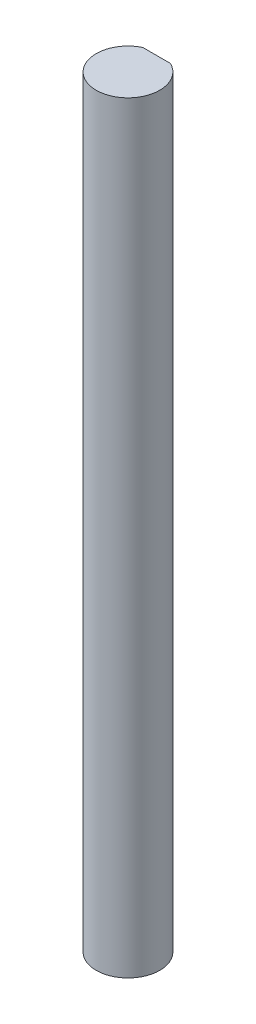
ISO-10303-21;
HEADER;
FILE_DESCRIPTION(('STEP AP214'),'2;1');
FILE_NAME('part.step','',(''),(''),'','','');
FILE_SCHEMA(('AUTOMOTIVE_DESIGN { 1 0 10303 214 1 1 1 1 }'));
ENDSEC;
DATA;
#1=APPLICATION_CONTEXT('core data for automotive mechanical design processes');
#2=APPLICATION_PROTOCOL_DEFINITION('international standard','automotive_design',2000,#1);
#3=PRODUCT_CONTEXT('',#1,'mechanical');
#4=PRODUCT('Part','Part','',(#3));
#5=PRODUCT_RELATED_PRODUCT_CATEGORY('part','',(#4));
#6=PRODUCT_DEFINITION_FORMATION('','',#4);
#7=PRODUCT_DEFINITION_CONTEXT('part definition',#1,'design');
#8=PRODUCT_DEFINITION('design','',#6,#7);
#9=PRODUCT_DEFINITION_SHAPE('','',#8);
#10=(LENGTH_UNIT() NAMED_UNIT(*) SI_UNIT(.MILLI.,.METRE.));
#11=(NAMED_UNIT(*) PLANE_ANGLE_UNIT() SI_UNIT($,.RADIAN.));
#12=(NAMED_UNIT(*) SI_UNIT($,.STERADIAN.) SOLID_ANGLE_UNIT());
#13=UNCERTAINTY_MEASURE_WITH_UNIT(LENGTH_MEASURE(1.E-05),#10,'distance_accuracy_value','');
#14=(GEOMETRIC_REPRESENTATION_CONTEXT(3) GLOBAL_UNCERTAINTY_ASSIGNED_CONTEXT((#13)) GLOBAL_UNIT_ASSIGNED_CONTEXT((#10,
#11,#12)) REPRESENTATION_CONTEXT('',''));
#15=CARTESIAN_POINT('',(0.,0.,0.));
#16=DIRECTION('',(0.,0.,1.));
#17=DIRECTION('',(1.,0.,0.));
#18=AXIS2_PLACEMENT_3D('',#15,#16,#17);
#19=CARTESIAN_POINT('',(0.,60.,0.));
#20=DIRECTION('',(0.,-1.,0.));
#21=DIRECTION('',(0.,0.,-1.));
#22=AXIS2_PLACEMENT_3D('',#19,#20,#21);
#23=CYLINDRICAL_SURFACE('',#22,2.5);
#24=CARTESIAN_POINT('',(0.,0.,0.));
#25=DIRECTION('',(0.,1.,0.));
#26=DIRECTION('',(0.,0.,1.));
#27=AXIS2_PLACEMENT_3D('',#24,#25,#26);
#28=CIRCLE('',#27,2.5);
#29=CARTESIAN_POINT('',(-1.08972473588517,0.,-2.25));
#30=VERTEX_POINT('',#29);
#31=CARTESIAN_POINT('',(1.08972473588517,0.,-2.25));
#32=VERTEX_POINT('',#31);
#33=EDGE_CURVE('E72',#30,#32,#28,.T.);
#34=ORIENTED_EDGE('',*,*,#33,.T.);
#35=DIRECTION('',(0.,-1.,0.));
#36=VECTOR('',#35,1.);
#37=CARTESIAN_POINT('',(1.08972473588517,60.,-2.25));
#38=LINE('',#37,#36);
#39=CARTESIAN_POINT('',(1.08972473588517,60.,-2.25));
#40=VERTEX_POINT('',#39);
#41=EDGE_CURVE('E11',#40,#32,#38,.T.);
#42=ORIENTED_EDGE('',*,*,#41,.F.);
#43=CARTESIAN_POINT('',(0.,60.,0.));
#44=DIRECTION('',(0.,1.,0.));
#45=DIRECTION('',(0.,0.,1.));
#46=AXIS2_PLACEMENT_3D('',#43,#44,#45);
#47=CIRCLE('',#46,2.5);
#48=CARTESIAN_POINT('',(-1.08972473588517,60.,-2.25));
#49=VERTEX_POINT('',#48);
#50=EDGE_CURVE('E71',#49,#40,#47,.T.);
#51=ORIENTED_EDGE('',*,*,#50,.F.);
#52=DIRECTION('',(0.,-1.,0.));
#53=VECTOR('',#52,1.);
#54=CARTESIAN_POINT('',(-1.08972473588517,60.,-2.25));
#55=LINE('',#54,#53);
#56=EDGE_CURVE('E49',#49,#30,#55,.T.);
#57=ORIENTED_EDGE('',*,*,#56,.T.);
#58=EDGE_LOOP('',(#34,#42,#51,#57));
#59=FACE_BOUND('',#58,.T.);
#60=ADVANCED_FACE('F41',(#59),#23,.T.);
#61=CARTESIAN_POINT('',(-1.08972473588517,60.,-2.25));
#62=DIRECTION('',(0.,0.,1.));
#63=DIRECTION('',(1.,0.,0.));
#64=AXIS2_PLACEMENT_3D('',#61,#62,#63);
#65=PLANE('',#64);
#66=DIRECTION('',(-1.,0.,0.));
#67=VECTOR('',#66,1.);
#68=CARTESIAN_POINT('',(-1.08972473588517,0.,-2.25));
#69=LINE('',#68,#67);
#70=EDGE_CURVE('E64',#32,#30,#69,.T.);
#71=ORIENTED_EDGE('',*,*,#70,.T.);
#72=ORIENTED_EDGE('',*,*,#56,.F.);
#73=DIRECTION('',(-1.,0.,0.));
#74=VECTOR('',#73,1.);
#75=CARTESIAN_POINT('',(-1.08972473588517,60.,-2.25));
#76=LINE('',#75,#74);
#77=EDGE_CURVE('E56',#40,#49,#76,.T.);
#78=ORIENTED_EDGE('',*,*,#77,.F.);
#79=ORIENTED_EDGE('',*,*,#41,.T.);
#80=EDGE_LOOP('',(#71,#72,#78,#79));
#81=FACE_BOUND('',#80,.T.);
#82=ADVANCED_FACE('F67',(#81),#65,.F.);
#83=CARTESIAN_POINT('',(0.,60.,0.));
#84=DIRECTION('',(0.,1.,0.));
#85=DIRECTION('',(0.,0.,1.));
#86=AXIS2_PLACEMENT_3D('',#83,#84,#85);
#87=PLANE('',#86);
#88=ORIENTED_EDGE('',*,*,#50,.T.);
#89=ORIENTED_EDGE('',*,*,#77,.T.);
#90=EDGE_LOOP('',(#88,#89));
#91=FACE_BOUND('',#90,.T.);
#92=ADVANCED_FACE('F79',(#91),#87,.T.);
#93=CARTESIAN_POINT('',(0.,0.,0.));
#94=DIRECTION('',(0.,1.,0.));
#95=DIRECTION('',(0.,0.,1.));
#96=AXIS2_PLACEMENT_3D('',#93,#94,#95);
#97=PLANE('',#96);
#98=ORIENTED_EDGE('',*,*,#33,.F.);
#99=ORIENTED_EDGE('',*,*,#70,.F.);
#100=EDGE_LOOP('',(#98,#99));
#101=FACE_BOUND('',#100,.T.);
#102=ADVANCED_FACE('F75',(#101),#97,.F.);
#103=CLOSED_SHELL('',(#60,#82,#92,#102));
#104=MANIFOLD_SOLID_BREP('B2',#103);
#105=ADVANCED_BREP_SHAPE_REPRESENTATION('',(#18,#104),#14);
#106=SHAPE_DEFINITION_REPRESENTATION(#9,#105);
ENDSEC;
END-ISO-10303-21;
